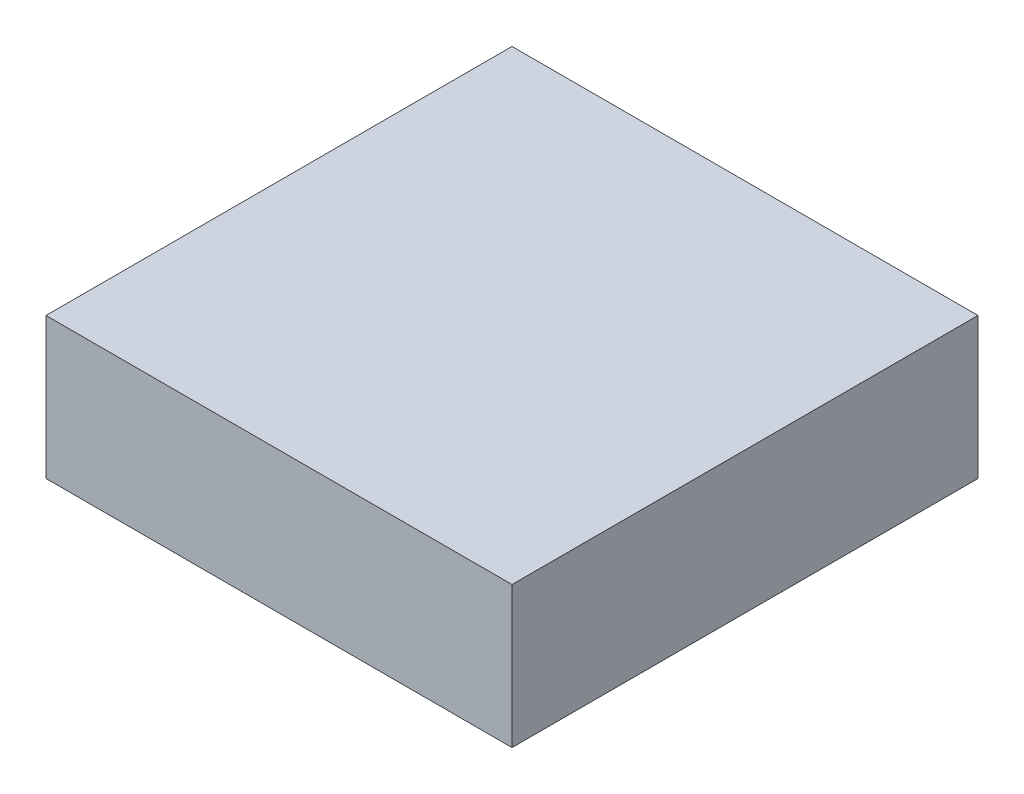
ISO-10303-21;
HEADER;
FILE_DESCRIPTION(('STEP AP214'),'2;1');
FILE_NAME('part.step','',(''),(''),'','','');
FILE_SCHEMA(('AUTOMOTIVE_DESIGN { 1 0 10303 214 1 1 1 1 }'));
ENDSEC;
DATA;
#1=APPLICATION_CONTEXT('core data for automotive mechanical design processes');
#2=APPLICATION_PROTOCOL_DEFINITION('international standard','automotive_design',2000,#1);
#3=PRODUCT_CONTEXT('',#1,'mechanical');
#4=PRODUCT('Part','Part','',(#3));
#5=PRODUCT_RELATED_PRODUCT_CATEGORY('part','',(#4));
#6=PRODUCT_DEFINITION_FORMATION('','',#4);
#7=PRODUCT_DEFINITION_CONTEXT('part definition',#1,'design');
#8=PRODUCT_DEFINITION('design','',#6,#7);
#9=PRODUCT_DEFINITION_SHAPE('','',#8);
#10=(LENGTH_UNIT() NAMED_UNIT(*) SI_UNIT(.MILLI.,.METRE.));
#11=(NAMED_UNIT(*) PLANE_ANGLE_UNIT() SI_UNIT($,.RADIAN.));
#12=(NAMED_UNIT(*) SI_UNIT($,.STERADIAN.) SOLID_ANGLE_UNIT());
#13=UNCERTAINTY_MEASURE_WITH_UNIT(LENGTH_MEASURE(1.E-05),#10,'distance_accuracy_value','');
#14=(GEOMETRIC_REPRESENTATION_CONTEXT(3) GLOBAL_UNCERTAINTY_ASSIGNED_CONTEXT((#13)) GLOBAL_UNIT_ASSIGNED_CONTEXT((#10,
#11,#12)) REPRESENTATION_CONTEXT('',''));
#15=CARTESIAN_POINT('',(0.,0.,0.));
#16=DIRECTION('',(0.,0.,1.));
#17=DIRECTION('',(1.,0.,0.));
#18=AXIS2_PLACEMENT_3D('',#15,#16,#17);
#19=CARTESIAN_POINT('',(20.85,-1.85,-11.525));
#20=DIRECTION('',(0.,-1.,0.));
#21=DIRECTION('',(1.,0.,0.));
#22=AXIS2_PLACEMENT_3D('',#19,#20,#21);
#23=PLANE('',#22);
#24=DIRECTION('',(1.,0.,0.));
#25=VECTOR('',#24,1.);
#26=CARTESIAN_POINT('',(22.5,-1.85,-8.225));
#27=LINE('',#26,#25);
#28=CARTESIAN_POINT('',(20.85,-1.85,-8.225));
#29=VERTEX_POINT('',#28);
#30=CARTESIAN_POINT('',(24.15,-1.85,-8.225));
#31=VERTEX_POINT('',#30);
#32=EDGE_CURVE('E54',#29,#31,#27,.T.);
#33=ORIENTED_EDGE('',*,*,#32,.F.);
#34=DIRECTION('',(0.,0.,1.));
#35=VECTOR('',#34,1.);
#36=CARTESIAN_POINT('',(20.85,-1.85,-9.875));
#37=LINE('',#36,#35);
#38=CARTESIAN_POINT('',(20.85,-1.85,-11.525));
#39=VERTEX_POINT('',#38);
#40=EDGE_CURVE('E69',#39,#29,#37,.T.);
#41=ORIENTED_EDGE('',*,*,#40,.F.);
#42=DIRECTION('',(-1.,0.,0.));
#43=VECTOR('',#42,1.);
#44=CARTESIAN_POINT('',(22.5,-1.85,-11.525));
#45=LINE('',#44,#43);
#46=CARTESIAN_POINT('',(24.15,-1.85,-11.525));
#47=VERTEX_POINT('',#46);
#48=EDGE_CURVE('E21',#47,#39,#45,.T.);
#49=ORIENTED_EDGE('',*,*,#48,.F.);
#50=DIRECTION('',(0.,0.,-1.));
#51=VECTOR('',#50,1.);
#52=CARTESIAN_POINT('',(24.15,-1.85,-9.875));
#53=LINE('',#52,#51);
#54=EDGE_CURVE('E59',#31,#47,#53,.T.);
#55=ORIENTED_EDGE('',*,*,#54,.F.);
#56=EDGE_LOOP('',(#33,#41,#49,#55));
#57=FACE_BOUND('',#56,.T.);
#58=ADVANCED_FACE('F17',(#57),#23,.T.);
#59=CARTESIAN_POINT('',(20.85,-0.85,-11.525));
#60=DIRECTION('',(0.,0.,-1.));
#61=DIRECTION('',(1.,0.,0.));
#62=AXIS2_PLACEMENT_3D('',#59,#60,#61);
#63=PLANE('',#62);
#64=ORIENTED_EDGE('',*,*,#48,.T.);
#65=DIRECTION('',(0.,-1.,0.));
#66=VECTOR('',#65,1.);
#67=CARTESIAN_POINT('',(20.85,-1.35,-11.525));
#68=LINE('',#67,#66);
#69=CARTESIAN_POINT('',(20.85,-0.85,-11.525));
#70=VERTEX_POINT('',#69);
#71=EDGE_CURVE('E80',#70,#39,#68,.T.);
#72=ORIENTED_EDGE('',*,*,#71,.F.);
#73=DIRECTION('',(1.,0.,0.));
#74=VECTOR('',#73,1.);
#75=CARTESIAN_POINT('',(22.5,-0.85,-11.525));
#76=LINE('',#75,#74);
#77=CARTESIAN_POINT('',(24.15,-0.85,-11.525));
#78=VERTEX_POINT('',#77);
#79=EDGE_CURVE('E75',#70,#78,#76,.T.);
#80=ORIENTED_EDGE('',*,*,#79,.T.);
#81=DIRECTION('',(0.,1.,0.));
#82=VECTOR('',#81,1.);
#83=CARTESIAN_POINT('',(24.15,-1.35,-11.525));
#84=LINE('',#83,#82);
#85=EDGE_CURVE('E64',#47,#78,#84,.T.);
#86=ORIENTED_EDGE('',*,*,#85,.F.);
#87=EDGE_LOOP('',(#64,#72,#80,#86));
#88=FACE_BOUND('',#87,.T.);
#89=ADVANCED_FACE('F74',(#88),#63,.T.);
#90=CARTESIAN_POINT('',(24.15,-0.85,-11.525));
#91=DIRECTION('',(1.,0.,0.));
#92=DIRECTION('',(0.,0.,1.));
#93=AXIS2_PLACEMENT_3D('',#90,#91,#92);
#94=PLANE('',#93);
#95=ORIENTED_EDGE('',*,*,#54,.T.);
#96=ORIENTED_EDGE('',*,*,#85,.T.);
#97=DIRECTION('',(0.,0.,1.));
#98=VECTOR('',#97,1.);
#99=CARTESIAN_POINT('',(24.15,-0.85,-9.875));
#100=LINE('',#99,#98);
#101=CARTESIAN_POINT('',(24.15,-0.85,-8.225));
#102=VERTEX_POINT('',#101);
#103=EDGE_CURVE('E85',#78,#102,#100,.T.);
#104=ORIENTED_EDGE('',*,*,#103,.T.);
#105=DIRECTION('',(0.,1.,0.));
#106=VECTOR('',#105,1.);
#107=CARTESIAN_POINT('',(24.15,-1.35,-8.225));
#108=LINE('',#107,#106);
#109=EDGE_CURVE('E66',#31,#102,#108,.T.);
#110=ORIENTED_EDGE('',*,*,#109,.F.);
#111=EDGE_LOOP('',(#95,#96,#104,#110));
#112=FACE_BOUND('',#111,.T.);
#113=ADVANCED_FACE('F61',(#112),#94,.T.);
#114=CARTESIAN_POINT('',(24.15,-0.85,-8.225));
#115=DIRECTION('',(0.,0.,1.));
#116=DIRECTION('',(-1.,0.,0.));
#117=AXIS2_PLACEMENT_3D('',#114,#115,#116);
#118=PLANE('',#117);
#119=ORIENTED_EDGE('',*,*,#32,.T.);
#120=ORIENTED_EDGE('',*,*,#109,.T.);
#121=DIRECTION('',(-1.,0.,0.));
#122=VECTOR('',#121,1.);
#123=CARTESIAN_POINT('',(22.5,-0.85,-8.225));
#124=LINE('',#123,#122);
#125=CARTESIAN_POINT('',(20.85,-0.85,-8.225));
#126=VERTEX_POINT('',#125);
#127=EDGE_CURVE('E27',#102,#126,#124,.T.);
#128=ORIENTED_EDGE('',*,*,#127,.T.);
#129=DIRECTION('',(0.,1.,0.));
#130=VECTOR('',#129,1.);
#131=CARTESIAN_POINT('',(20.85,-1.35,-8.225));
#132=LINE('',#131,#130);
#133=EDGE_CURVE('E35',#29,#126,#132,.T.);
#134=ORIENTED_EDGE('',*,*,#133,.F.);
#135=EDGE_LOOP('',(#119,#120,#128,#134));
#136=FACE_BOUND('',#135,.T.);
#137=ADVANCED_FACE('F89',(#136),#118,.T.);
#138=CARTESIAN_POINT('',(20.85,-0.85,-8.225));
#139=DIRECTION('',(-1.,0.,0.));
#140=DIRECTION('',(0.,0.,-1.));
#141=AXIS2_PLACEMENT_3D('',#138,#139,#140);
#142=PLANE('',#141);
#143=ORIENTED_EDGE('',*,*,#40,.T.);
#144=ORIENTED_EDGE('',*,*,#133,.T.);
#145=DIRECTION('',(0.,0.,-1.));
#146=VECTOR('',#145,1.);
#147=CARTESIAN_POINT('',(20.85,-0.85,-9.875));
#148=LINE('',#147,#146);
#149=EDGE_CURVE('E11',#126,#70,#148,.T.);
#150=ORIENTED_EDGE('',*,*,#149,.T.);
#151=ORIENTED_EDGE('',*,*,#71,.T.);
#152=EDGE_LOOP('',(#143,#144,#150,#151));
#153=FACE_BOUND('',#152,.T.);
#154=ADVANCED_FACE('F91',(#153),#142,.T.);
#155=CARTESIAN_POINT('',(20.85,-0.85,-11.525));
#156=DIRECTION('',(0.,-1.,0.));
#157=DIRECTION('',(1.,0.,0.));
#158=AXIS2_PLACEMENT_3D('',#155,#156,#157);
#159=PLANE('',#158);
#160=ORIENTED_EDGE('',*,*,#127,.F.);
#161=ORIENTED_EDGE('',*,*,#103,.F.);
#162=ORIENTED_EDGE('',*,*,#79,.F.);
#163=ORIENTED_EDGE('',*,*,#149,.F.);
#164=EDGE_LOOP('',(#160,#161,#162,#163));
#165=FACE_BOUND('',#164,.T.);
#166=ADVANCED_FACE('F19',(#165),#159,.F.);
#167=CLOSED_SHELL('',(#58,#89,#113,#137,#154,#166));
#168=MANIFOLD_SOLID_BREP('B1',#167);
#169=ADVANCED_BREP_SHAPE_REPRESENTATION('',(#18,#168),#14);
#170=SHAPE_DEFINITION_REPRESENTATION(#9,#169);
ENDSEC;
END-ISO-10303-21;
